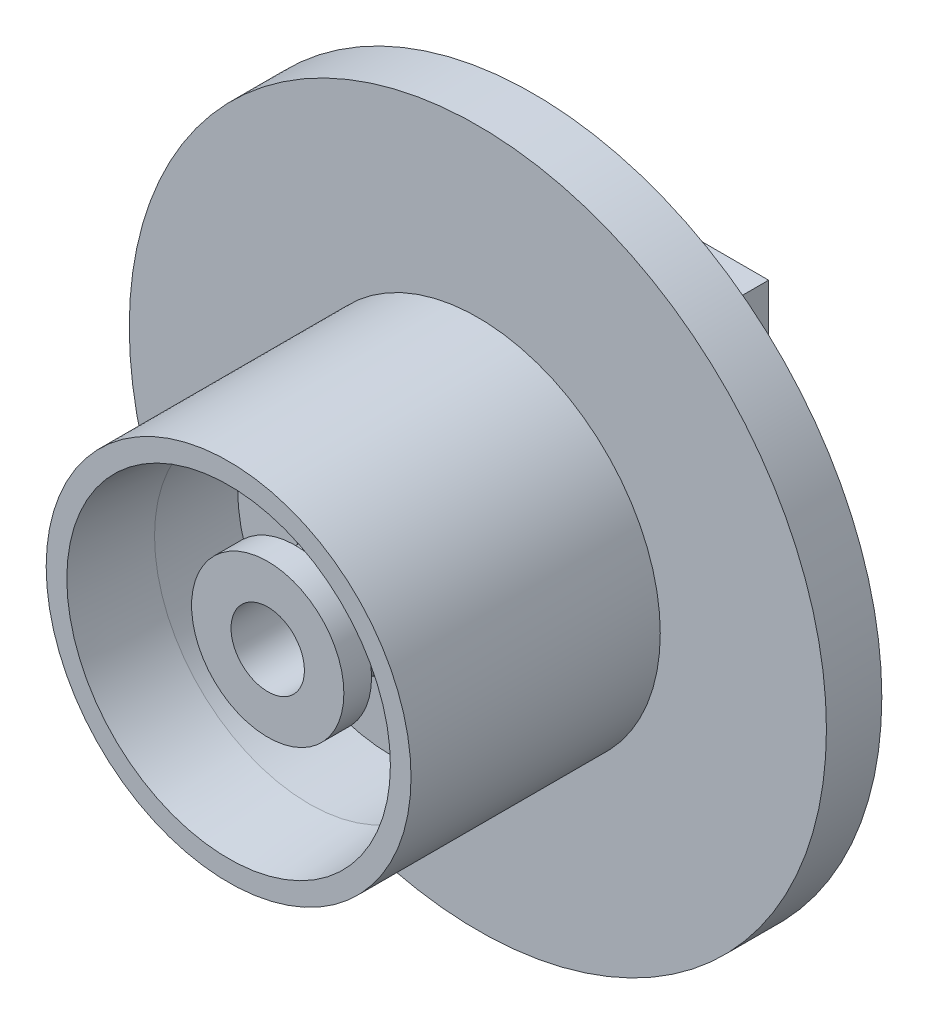
ISO-10303-21;
HEADER;
FILE_DESCRIPTION(('STEP AP214'),'2;1');
FILE_NAME('part.step','',(''),(''),'','','');
FILE_SCHEMA(('AUTOMOTIVE_DESIGN { 1 0 10303 214 1 1 1 1 }'));
ENDSEC;
DATA;
#1=APPLICATION_CONTEXT('core data for automotive mechanical design processes');
#2=APPLICATION_PROTOCOL_DEFINITION('international standard','automotive_design',2000,#1);
#3=PRODUCT_CONTEXT('',#1,'mechanical');
#4=PRODUCT('Part','Part','',(#3));
#5=PRODUCT_RELATED_PRODUCT_CATEGORY('part','',(#4));
#6=PRODUCT_DEFINITION_FORMATION('','',#4);
#7=PRODUCT_DEFINITION_CONTEXT('part definition',#1,'design');
#8=PRODUCT_DEFINITION('design','',#6,#7);
#9=PRODUCT_DEFINITION_SHAPE('','',#8);
#10=(LENGTH_UNIT() NAMED_UNIT(*) SI_UNIT(.MILLI.,.METRE.));
#11=(NAMED_UNIT(*) PLANE_ANGLE_UNIT() SI_UNIT($,.RADIAN.));
#12=(NAMED_UNIT(*) SI_UNIT($,.STERADIAN.) SOLID_ANGLE_UNIT());
#13=UNCERTAINTY_MEASURE_WITH_UNIT(LENGTH_MEASURE(1.E-05),#10,'distance_accuracy_value','');
#14=(GEOMETRIC_REPRESENTATION_CONTEXT(3) GLOBAL_UNCERTAINTY_ASSIGNED_CONTEXT((#13)) GLOBAL_UNIT_ASSIGNED_CONTEXT((#10,
#11,#12)) REPRESENTATION_CONTEXT('',''));
#15=CARTESIAN_POINT('',(0.,0.,0.));
#16=DIRECTION('',(0.,0.,1.));
#17=DIRECTION('',(1.,0.,0.));
#18=AXIS2_PLACEMENT_3D('',#15,#16,#17);
#19=CARTESIAN_POINT('',(0.,0.,-3.96015510839148));
#20=DIRECTION('',(0.,0.,1.));
#21=DIRECTION('',(1.,0.,0.));
#22=AXIS2_PLACEMENT_3D('',#19,#20,#21);
#23=CYLINDRICAL_SURFACE('',#22,2.65);
#24=CARTESIAN_POINT('',(0.,0.,7.4));
#25=DIRECTION('',(0.,0.,1.));
#26=DIRECTION('',(1.,0.,0.));
#27=AXIS2_PLACEMENT_3D('',#24,#25,#26);
#28=CIRCLE('',#27,2.65);
#29=CARTESIAN_POINT('',(2.65,0.,7.4));
#30=VERTEX_POINT('',#29);
#31=EDGE_CURVE('E81',#30,#30,#28,.F.);
#32=ORIENTED_EDGE('',*,*,#31,.T.);
#33=EDGE_LOOP('',(#32));
#34=FACE_BOUND('',#33,.T.);
#35=CARTESIAN_POINT('',(0.,0.,19.175));
#36=DIRECTION('',(0.,0.,1.));
#37=DIRECTION('',(1.,0.,0.));
#38=AXIS2_PLACEMENT_3D('',#35,#36,#37);
#39=CIRCLE('',#38,2.65);
#40=CARTESIAN_POINT('',(2.65,0.,19.175));
#41=VERTEX_POINT('',#40);
#42=EDGE_CURVE('E86',#41,#41,#39,.T.);
#43=ORIENTED_EDGE('',*,*,#42,.T.);
#44=EDGE_LOOP('',(#43));
#45=FACE_BOUND('',#44,.T.);
#46=ADVANCED_FACE('F70',(#34,#45),#23,.F.);
#47=CARTESIAN_POINT('',(0.,0.,-3.96015510839148));
#48=DIRECTION('',(0.,0.,1.));
#49=DIRECTION('',(1.,0.,0.));
#50=AXIS2_PLACEMENT_3D('',#47,#48,#49);
#51=CYLINDRICAL_SURFACE('',#50,3.875);
#52=CARTESIAN_POINT('',(0.,0.,7.4));
#53=DIRECTION('',(0.,0.,1.));
#54=DIRECTION('',(1.,0.,0.));
#55=AXIS2_PLACEMENT_3D('',#52,#53,#54);
#56=CIRCLE('',#55,3.875);
#57=CARTESIAN_POINT('',(3.875,0.,7.4));
#58=VERTEX_POINT('',#57);
#59=EDGE_CURVE('E13',#58,#58,#56,.F.);
#60=ORIENTED_EDGE('',*,*,#59,.F.);
#61=EDGE_LOOP('',(#60));
#62=FACE_BOUND('',#61,.T.);
#63=CARTESIAN_POINT('',(0.,0.,17.175));
#64=DIRECTION('',(0.,0.,1.));
#65=DIRECTION('',(1.,0.,0.));
#66=AXIS2_PLACEMENT_3D('',#63,#64,#65);
#67=CIRCLE('',#66,3.875);
#68=CARTESIAN_POINT('',(3.875,0.,17.175));
#69=VERTEX_POINT('',#68);
#70=EDGE_CURVE('E77',#69,#69,#67,.T.);
#71=ORIENTED_EDGE('',*,*,#70,.F.);
#72=EDGE_LOOP('',(#71));
#73=FACE_BOUND('',#72,.T.);
#74=ADVANCED_FACE('F114',(#62,#73),#51,.T.);
#75=CARTESIAN_POINT('',(0.,0.,7.4));
#76=DIRECTION('',(0.,0.,1.));
#77=DIRECTION('',(1.,0.,0.));
#78=AXIS2_PLACEMENT_3D('',#75,#76,#77);
#79=PLANE('',#78);
#80=ORIENTED_EDGE('',*,*,#59,.T.);
#81=EDGE_LOOP('',(#80));
#82=FACE_BOUND('',#81,.T.);
#83=ORIENTED_EDGE('',*,*,#31,.F.);
#84=EDGE_LOOP('',(#83));
#85=FACE_BOUND('',#84,.T.);
#86=ADVANCED_FACE('F72',(#82,#85),#79,.F.);
#87=CARTESIAN_POINT('',(0.,0.,19.175));
#88=DIRECTION('',(0.,0.,-1.));
#89=DIRECTION('',(-1.,0.,0.));
#90=AXIS2_PLACEMENT_3D('',#87,#88,#89);
#91=CYLINDRICAL_SURFACE('',#90,5.5);
#92=CARTESIAN_POINT('',(0.,0.,19.175));
#93=DIRECTION('',(0.,0.,1.));
#94=DIRECTION('',(1.,0.,0.));
#95=AXIS2_PLACEMENT_3D('',#92,#93,#94);
#96=CIRCLE('',#95,5.5);
#97=CARTESIAN_POINT('',(5.5,0.,19.175));
#98=VERTEX_POINT('',#97);
#99=EDGE_CURVE('E91',#98,#98,#96,.T.);
#100=ORIENTED_EDGE('',*,*,#99,.F.);
#101=EDGE_LOOP('',(#100));
#102=FACE_BOUND('',#101,.T.);
#103=CARTESIAN_POINT('',(0.,0.,17.175));
#104=DIRECTION('',(0.,0.,1.));
#105=DIRECTION('',(1.,0.,0.));
#106=AXIS2_PLACEMENT_3D('',#103,#104,#105);
#107=CIRCLE('',#106,5.5);
#108=CARTESIAN_POINT('',(5.5,0.,17.175));
#109=VERTEX_POINT('',#108);
#110=EDGE_CURVE('E88',#109,#109,#107,.T.);
#111=ORIENTED_EDGE('',*,*,#110,.T.);
#112=EDGE_LOOP('',(#111));
#113=FACE_BOUND('',#112,.T.);
#114=ADVANCED_FACE('F100',(#102,#113),#91,.T.);
#115=CARTESIAN_POINT('',(0.,0.,19.175));
#116=DIRECTION('',(0.,0.,1.));
#117=DIRECTION('',(1.,0.,0.));
#118=AXIS2_PLACEMENT_3D('',#115,#116,#117);
#119=PLANE('',#118);
#120=ORIENTED_EDGE('',*,*,#99,.T.);
#121=EDGE_LOOP('',(#120));
#122=FACE_BOUND('',#121,.T.);
#123=ORIENTED_EDGE('',*,*,#42,.F.);
#124=EDGE_LOOP('',(#123));
#125=FACE_BOUND('',#124,.T.);
#126=ADVANCED_FACE('F97',(#122,#125),#119,.T.);
#127=CARTESIAN_POINT('',(0.,0.,17.175));
#128=DIRECTION('',(0.,0.,1.));
#129=DIRECTION('',(1.,0.,0.));
#130=AXIS2_PLACEMENT_3D('',#127,#128,#129);
#131=PLANE('',#130);
#132=ORIENTED_EDGE('',*,*,#70,.T.);
#133=EDGE_LOOP('',(#132));
#134=FACE_BOUND('',#133,.T.);
#135=ORIENTED_EDGE('',*,*,#110,.F.);
#136=EDGE_LOOP('',(#135));
#137=FACE_BOUND('',#136,.T.);
#138=ADVANCED_FACE('F106',(#134,#137),#131,.F.);
#139=CLOSED_SHELL('',(#46,#74,#86,#114,#126,#138));
#140=MANIFOLD_SOLID_BREP('B2',#139);
#141=CARTESIAN_POINT('',(0.,0.,7.));
#142=DIRECTION('',(0.,0.,-1.));
#143=DIRECTION('',(-1.,0.,0.));
#144=AXIS2_PLACEMENT_3D('',#141,#142,#143);
#145=CYLINDRICAL_SURFACE('',#144,3.875);
#146=CARTESIAN_POINT('',(0.,0.,7.));
#147=DIRECTION('',(0.,0.,1.));
#148=DIRECTION('',(1.,0.,0.));
#149=AXIS2_PLACEMENT_3D('',#146,#147,#148);
#150=CIRCLE('',#149,3.875);
#151=CARTESIAN_POINT('',(3.875,0.,7.));
#152=VERTEX_POINT('',#151);
#153=EDGE_CURVE('E314',#152,#152,#150,.T.);
#154=ORIENTED_EDGE('',*,*,#153,.F.);
#155=EDGE_LOOP('',(#154));
#156=FACE_BOUND('',#155,.T.);
#157=CARTESIAN_POINT('',(0.,0.,-2.));
#158=DIRECTION('',(0.,0.,-1.));
#159=DIRECTION('',(-1.,0.,0.));
#160=AXIS2_PLACEMENT_3D('',#157,#158,#159);
#161=CIRCLE('',#160,3.875);
#162=CARTESIAN_POINT('',(-3.875,0.,-2.));
#163=VERTEX_POINT('',#162);
#164=EDGE_CURVE('E68',#163,#163,#161,.T.);
#165=ORIENTED_EDGE('',*,*,#164,.F.);
#166=EDGE_LOOP('',(#165));
#167=FACE_BOUND('',#166,.T.);
#168=ADVANCED_FACE('F178',(#156,#167),#145,.T.);
#169=CARTESIAN_POINT('',(0.,0.,-3.));
#170=DIRECTION('',(0.,0.,1.));
#171=DIRECTION('',(1.,0.,0.));
#172=AXIS2_PLACEMENT_3D('',#169,#170,#171);
#173=PLANE('',#172);
#174=CARTESIAN_POINT('',(0.,0.,-3.));
#175=DIRECTION('',(0.,0.,1.));
#176=DIRECTION('',(1.,0.,0.));
#177=AXIS2_PLACEMENT_3D('',#174,#175,#176);
#178=CIRCLE('',#177,5.5);
#179=CARTESIAN_POINT('',(5.5,0.,-3.));
#180=VERTEX_POINT('',#179);
#181=EDGE_CURVE('E306',#180,#180,#178,.T.);
#182=ORIENTED_EDGE('',*,*,#181,.F.);
#183=EDGE_LOOP('',(#182));
#184=FACE_BOUND('',#183,.T.);
#185=DIRECTION('',(0.,1.,0.));
#186=VECTOR('',#185,1.);
#187=CARTESIAN_POINT('',(10.,-15.,-3.));
#188=LINE('',#187,#186);
#189=CARTESIAN_POINT('',(10.,-15.,-3.));
#190=VERTEX_POINT('',#189);
#191=CARTESIAN_POINT('',(10.,15.,-3.));
#192=VERTEX_POINT('',#191);
#193=EDGE_CURVE('E248',#190,#192,#188,.T.);
#194=ORIENTED_EDGE('',*,*,#193,.T.);
#195=DIRECTION('',(-1.,0.,0.));
#196=VECTOR('',#195,1.);
#197=CARTESIAN_POINT('',(10.,15.,-3.));
#198=LINE('',#197,#196);
#199=CARTESIAN_POINT('',(-10.,15.,-3.));
#200=VERTEX_POINT('',#199);
#201=EDGE_CURVE('E251',#192,#200,#198,.T.);
#202=ORIENTED_EDGE('',*,*,#201,.T.);
#203=DIRECTION('',(0.,1.,0.));
#204=VECTOR('',#203,1.);
#205=CARTESIAN_POINT('',(-10.,-15.,-3.));
#206=LINE('',#205,#204);
#207=CARTESIAN_POINT('',(-10.,-15.,-3.));
#208=VERTEX_POINT('',#207);
#209=EDGE_CURVE('E237',#208,#200,#206,.T.);
#210=ORIENTED_EDGE('',*,*,#209,.F.);
#211=DIRECTION('',(-1.,0.,0.));
#212=VECTOR('',#211,1.);
#213=CARTESIAN_POINT('',(10.,-15.,-3.));
#214=LINE('',#213,#212);
#215=EDGE_CURVE('E211',#190,#208,#214,.T.);
#216=ORIENTED_EDGE('',*,*,#215,.F.);
#217=EDGE_LOOP('',(#194,#202,#210,#216));
#218=FACE_BOUND('',#217,.T.);
#219=ADVANCED_FACE('F258',(#184,#218),#173,.T.);
#220=CARTESIAN_POINT('',(0.,0.,-7.));
#221=DIRECTION('',(0.,0.,1.));
#222=DIRECTION('',(1.,0.,0.));
#223=AXIS2_PLACEMENT_3D('',#220,#221,#222);
#224=PLANE('',#223);
#225=DIRECTION('',(0.,1.,0.));
#226=VECTOR('',#225,1.);
#227=CARTESIAN_POINT('',(10.,-15.,-7.));
#228=LINE('',#227,#226);
#229=CARTESIAN_POINT('',(10.,-15.,-7.));
#230=VERTEX_POINT('',#229);
#231=CARTESIAN_POINT('',(10.,15.,-7.));
#232=VERTEX_POINT('',#231);
#233=EDGE_CURVE('E242',#230,#232,#228,.T.);
#234=ORIENTED_EDGE('',*,*,#233,.F.);
#235=DIRECTION('',(-1.,0.,0.));
#236=VECTOR('',#235,1.);
#237=CARTESIAN_POINT('',(10.,-15.,-7.));
#238=LINE('',#237,#236);
#239=CARTESIAN_POINT('',(-10.,-15.,-7.));
#240=VERTEX_POINT('',#239);
#241=EDGE_CURVE('E230',#230,#240,#238,.T.);
#242=ORIENTED_EDGE('',*,*,#241,.T.);
#243=DIRECTION('',(0.,1.,0.));
#244=VECTOR('',#243,1.);
#245=CARTESIAN_POINT('',(-10.,-15.,-7.));
#246=LINE('',#245,#244);
#247=CARTESIAN_POINT('',(-10.,15.,-7.));
#248=VERTEX_POINT('',#247);
#249=EDGE_CURVE('E224',#240,#248,#246,.T.);
#250=ORIENTED_EDGE('',*,*,#249,.T.);
#251=DIRECTION('',(-1.,0.,0.));
#252=VECTOR('',#251,1.);
#253=CARTESIAN_POINT('',(10.,15.,-7.));
#254=LINE('',#253,#252);
#255=EDGE_CURVE('E229',#232,#248,#254,.T.);
#256=ORIENTED_EDGE('',*,*,#255,.F.);
#257=EDGE_LOOP('',(#234,#242,#250,#256));
#258=FACE_BOUND('',#257,.T.);
#259=CARTESIAN_POINT('',(0.,0.,-7.));
#260=DIRECTION('',(0.,0.,-1.));
#261=DIRECTION('',(-1.,0.,0.));
#262=AXIS2_PLACEMENT_3D('',#259,#260,#261);
#263=CIRCLE('',#262,2.65);
#264=CARTESIAN_POINT('',(-2.65,0.,-7.));
#265=VERTEX_POINT('',#264);
#266=EDGE_CURVE('E252',#265,#265,#263,.T.);
#267=ORIENTED_EDGE('',*,*,#266,.F.);
#268=EDGE_LOOP('',(#267));
#269=FACE_BOUND('',#268,.T.);
#270=ADVANCED_FACE('F227',(#258,#269),#224,.F.);
#271=CARTESIAN_POINT('',(10.,-15.,-7.));
#272=DIRECTION('',(1.,0.,0.));
#273=DIRECTION('',(0.,0.,-1.));
#274=AXIS2_PLACEMENT_3D('',#271,#272,#273);
#275=PLANE('',#274);
#276=ORIENTED_EDGE('',*,*,#193,.F.);
#277=DIRECTION('',(0.,0.,1.));
#278=VECTOR('',#277,1.);
#279=CARTESIAN_POINT('',(10.,-15.,-7.));
#280=LINE('',#279,#278);
#281=EDGE_CURVE('E187',#230,#190,#280,.T.);
#282=ORIENTED_EDGE('',*,*,#281,.F.);
#283=ORIENTED_EDGE('',*,*,#233,.T.);
#284=DIRECTION('',(0.,0.,1.));
#285=VECTOR('',#284,1.);
#286=CARTESIAN_POINT('',(10.,15.,-7.));
#287=LINE('',#286,#285);
#288=EDGE_CURVE('E219',#232,#192,#287,.T.);
#289=ORIENTED_EDGE('',*,*,#288,.T.);
#290=EDGE_LOOP('',(#276,#282,#283,#289));
#291=FACE_BOUND('',#290,.T.);
#292=ADVANCED_FACE('F180',(#291),#275,.T.);
#293=CARTESIAN_POINT('',(10.,-15.,-7.));
#294=DIRECTION('',(0.,1.,0.));
#295=DIRECTION('',(0.,0.,1.));
#296=AXIS2_PLACEMENT_3D('',#293,#294,#295);
#297=PLANE('',#296);
#298=ORIENTED_EDGE('',*,*,#215,.T.);
#299=DIRECTION('',(0.,0.,1.));
#300=VECTOR('',#299,1.);
#301=CARTESIAN_POINT('',(-10.,-15.,-7.));
#302=LINE('',#301,#300);
#303=EDGE_CURVE('E239',#240,#208,#302,.T.);
#304=ORIENTED_EDGE('',*,*,#303,.F.);
#305=ORIENTED_EDGE('',*,*,#241,.F.);
#306=ORIENTED_EDGE('',*,*,#281,.T.);
#307=EDGE_LOOP('',(#298,#304,#305,#306));
#308=FACE_BOUND('',#307,.T.);
#309=ADVANCED_FACE('F272',(#308),#297,.F.);
#310=CARTESIAN_POINT('',(-10.,-15.,-7.));
#311=DIRECTION('',(1.,0.,0.));
#312=DIRECTION('',(0.,0.,-1.));
#313=AXIS2_PLACEMENT_3D('',#310,#311,#312);
#314=PLANE('',#313);
#315=ORIENTED_EDGE('',*,*,#209,.T.);
#316=DIRECTION('',(0.,0.,1.));
#317=VECTOR('',#316,1.);
#318=CARTESIAN_POINT('',(-10.,15.,-7.));
#319=LINE('',#318,#317);
#320=EDGE_CURVE('E234',#248,#200,#319,.T.);
#321=ORIENTED_EDGE('',*,*,#320,.F.);
#322=ORIENTED_EDGE('',*,*,#249,.F.);
#323=ORIENTED_EDGE('',*,*,#303,.T.);
#324=EDGE_LOOP('',(#315,#321,#322,#323));
#325=FACE_BOUND('',#324,.T.);
#326=ADVANCED_FACE('F235',(#325),#314,.F.);
#327=CARTESIAN_POINT('',(10.,15.,-7.));
#328=DIRECTION('',(0.,1.,0.));
#329=DIRECTION('',(0.,0.,1.));
#330=AXIS2_PLACEMENT_3D('',#327,#328,#329);
#331=PLANE('',#330);
#332=ORIENTED_EDGE('',*,*,#201,.F.);
#333=ORIENTED_EDGE('',*,*,#288,.F.);
#334=ORIENTED_EDGE('',*,*,#255,.T.);
#335=ORIENTED_EDGE('',*,*,#320,.T.);
#336=EDGE_LOOP('',(#332,#333,#334,#335));
#337=FACE_BOUND('',#336,.T.);
#338=ADVANCED_FACE('F241',(#337),#331,.T.);
#339=CARTESIAN_POINT('',(0.,0.,-7.));
#340=DIRECTION('',(0.,0.,1.));
#341=DIRECTION('',(1.,0.,0.));
#342=AXIS2_PLACEMENT_3D('',#339,#340,#341);
#343=CYLINDRICAL_SURFACE('',#342,2.65);
#344=ORIENTED_EDGE('',*,*,#266,.T.);
#345=EDGE_LOOP('',(#344));
#346=FACE_BOUND('',#345,.T.);
#347=CARTESIAN_POINT('',(0.,0.,7.));
#348=DIRECTION('',(0.,0.,1.));
#349=DIRECTION('',(1.,0.,0.));
#350=AXIS2_PLACEMENT_3D('',#347,#348,#349);
#351=CIRCLE('',#350,2.65);
#352=CARTESIAN_POINT('',(2.65,0.,7.));
#353=VERTEX_POINT('',#352);
#354=EDGE_CURVE('E309',#353,#353,#351,.T.);
#355=ORIENTED_EDGE('',*,*,#354,.T.);
#356=EDGE_LOOP('',(#355));
#357=FACE_BOUND('',#356,.T.);
#358=ADVANCED_FACE('F277',(#346,#357),#343,.F.);
#359=CARTESIAN_POINT('',(0.,0.,7.));
#360=DIRECTION('',(0.,0.,1.));
#361=DIRECTION('',(1.,0.,0.));
#362=AXIS2_PLACEMENT_3D('',#359,#360,#361);
#363=PLANE('',#362);
#364=ORIENTED_EDGE('',*,*,#153,.T.);
#365=EDGE_LOOP('',(#364));
#366=FACE_BOUND('',#365,.T.);
#367=ORIENTED_EDGE('',*,*,#354,.F.);
#368=EDGE_LOOP('',(#367));
#369=FACE_BOUND('',#368,.T.);
#370=ADVANCED_FACE('F281',(#366,#369),#363,.T.);
#371=CARTESIAN_POINT('',(0.,0.,-2.));
#372=DIRECTION('',(0.,0.,-1.));
#373=DIRECTION('',(-1.,0.,0.));
#374=AXIS2_PLACEMENT_3D('',#371,#372,#373);
#375=PLANE('',#374);
#376=ORIENTED_EDGE('',*,*,#164,.T.);
#377=EDGE_LOOP('',(#376));
#378=FACE_BOUND('',#377,.T.);
#379=CARTESIAN_POINT('',(0.,0.,-2.));
#380=DIRECTION('',(0.,0.,-1.));
#381=DIRECTION('',(-1.,0.,0.));
#382=AXIS2_PLACEMENT_3D('',#379,#380,#381);
#383=CIRCLE('',#382,5.5);
#384=CARTESIAN_POINT('',(-5.5,0.,-2.));
#385=VERTEX_POINT('',#384);
#386=EDGE_CURVE('E304',#385,#385,#383,.T.);
#387=ORIENTED_EDGE('',*,*,#386,.F.);
#388=EDGE_LOOP('',(#387));
#389=FACE_BOUND('',#388,.T.);
#390=ADVANCED_FACE('F286',(#378,#389),#375,.F.);
#391=CARTESIAN_POINT('',(0.,0.,-18.556349186104));
#392=DIRECTION('',(0.,0.,1.));
#393=DIRECTION('',(1.,0.,0.));
#394=AXIS2_PLACEMENT_3D('',#391,#392,#393);
#395=CYLINDRICAL_SURFACE('',#394,5.5);
#396=ORIENTED_EDGE('',*,*,#181,.T.);
#397=EDGE_LOOP('',(#396));
#398=FACE_BOUND('',#397,.T.);
#399=ORIENTED_EDGE('',*,*,#386,.T.);
#400=EDGE_LOOP('',(#399));
#401=FACE_BOUND('',#400,.T.);
#402=ADVANCED_FACE('F292',(#398,#401),#395,.T.);
#403=CLOSED_SHELL('',(#168,#219,#270,#292,#309,#326,#338,#358,#370,#390,#402));
#404=MANIFOLD_SOLID_BREP('B8',#403);
#405=CARTESIAN_POINT('',(25.175,0.,0.));
#406=DIRECTION('',(0.,0.,1.));
#407=DIRECTION('',(1.,0.,0.));
#408=AXIS2_PLACEMENT_3D('',#405,#406,#407);
#409=PLANE('',#408);
#410=CARTESIAN_POINT('',(0.,0.,0.));
#411=DIRECTION('',(0.,0.,-1.));
#412=DIRECTION('',(-1.,0.,0.));
#413=AXIS2_PLACEMENT_3D('',#410,#411,#412);
#414=CIRCLE('',#413,11.175);
#415=CARTESIAN_POINT('',(-11.175,0.,0.));
#416=VERTEX_POINT('',#415);
#417=EDGE_CURVE('E177',#416,#416,#414,.T.);
#418=ORIENTED_EDGE('',*,*,#417,.F.);
#419=EDGE_LOOP('',(#418));
#420=FACE_BOUND('',#419,.T.);
#421=CARTESIAN_POINT('',(0.,0.,0.));
#422=DIRECTION('',(0.,0.,-1.));
#423=DIRECTION('',(-1.,0.,0.));
#424=AXIS2_PLACEMENT_3D('',#421,#422,#423);
#425=CIRCLE('',#424,25.175);
#426=CARTESIAN_POINT('',(-25.175,0.,0.));
#427=VERTEX_POINT('',#426);
#428=EDGE_CURVE('E422',#427,#427,#425,.T.);
#429=ORIENTED_EDGE('',*,*,#428,.T.);
#430=EDGE_LOOP('',(#429));
#431=FACE_BOUND('',#430,.T.);
#432=ADVANCED_FACE('F385',(#420,#431),#409,.F.);
#433=CARTESIAN_POINT('',(0.,0.,0.));
#434=DIRECTION('',(0.,0.,-1.));
#435=DIRECTION('',(-1.,0.,0.));
#436=AXIS2_PLACEMENT_3D('',#433,#434,#435);
#437=CYLINDRICAL_SURFACE('',#436,11.175);
#438=CARTESIAN_POINT('',(0.,0.,5.));
#439=DIRECTION('',(0.,0.,-1.));
#440=DIRECTION('',(-1.,0.,0.));
#441=AXIS2_PLACEMENT_3D('',#438,#439,#440);
#442=CIRCLE('',#441,11.175);
#443=CARTESIAN_POINT('',(-11.175,0.,5.00000000000001));
#444=VERTEX_POINT('',#443);
#445=EDGE_CURVE('E391',#444,#444,#442,.T.);
#446=ORIENTED_EDGE('',*,*,#445,.F.);
#447=EDGE_LOOP('',(#446));
#448=FACE_BOUND('',#447,.T.);
#449=ORIENTED_EDGE('',*,*,#417,.T.);
#450=EDGE_LOOP('',(#449));
#451=FACE_BOUND('',#450,.T.);
#452=ADVANCED_FACE('F477',(#448,#451),#437,.F.);
#453=CARTESIAN_POINT('',(0.,0.,5.));
#454=DIRECTION('',(0.,0.,-1.));
#455=DIRECTION('',(-1.,0.,0.));
#456=AXIS2_PLACEMENT_3D('',#453,#454,#455);
#457=CONICAL_SURFACE('',#456,11.175,0.785398163397451);
#458=CARTESIAN_POINT('',(0.,0.,9.17499999999998));
#459=DIRECTION('',(0.,0.,-1.));
#460=DIRECTION('',(-1.,0.,0.));
#461=AXIS2_PLACEMENT_3D('',#458,#459,#460);
#462=CIRCLE('',#461,7.);
#463=CARTESIAN_POINT('',(-7.,0.,9.17499999999998));
#464=VERTEX_POINT('',#463);
#465=EDGE_CURVE('E395',#464,#464,#462,.T.);
#466=ORIENTED_EDGE('',*,*,#465,.F.);
#467=EDGE_LOOP('',(#466));
#468=FACE_BOUND('',#467,.T.);
#469=ORIENTED_EDGE('',*,*,#445,.T.);
#470=EDGE_LOOP('',(#469));
#471=FACE_BOUND('',#470,.T.);
#472=ADVANCED_FACE('F472',(#468,#471),#457,.F.);
#473=CARTESIAN_POINT('',(0.,0.,0.));
#474=DIRECTION('',(0.,0.,-1.));
#475=DIRECTION('',(-1.,0.,0.));
#476=AXIS2_PLACEMENT_3D('',#473,#474,#475);
#477=CYLINDRICAL_SURFACE('',#476,7.);
#478=CARTESIAN_POINT('',(0.,0.,10.175));
#479=DIRECTION('',(0.,0.,-1.));
#480=DIRECTION('',(-1.,0.,0.));
#481=AXIS2_PLACEMENT_3D('',#478,#479,#480);
#482=CIRCLE('',#481,7.);
#483=CARTESIAN_POINT('',(-7.,0.,10.175));
#484=VERTEX_POINT('',#483);
#485=EDGE_CURVE('E399',#484,#484,#482,.T.);
#486=ORIENTED_EDGE('',*,*,#485,.F.);
#487=EDGE_LOOP('',(#486));
#488=FACE_BOUND('',#487,.T.);
#489=ORIENTED_EDGE('',*,*,#465,.T.);
#490=EDGE_LOOP('',(#489));
#491=FACE_BOUND('',#490,.T.);
#492=ADVANCED_FACE('F466',(#488,#491),#477,.F.);
#493=CARTESIAN_POINT('',(7.,0.,10.175));
#494=DIRECTION('',(0.,0.,-1.));
#495=DIRECTION('',(-1.,0.,0.));
#496=AXIS2_PLACEMENT_3D('',#493,#494,#495);
#497=PLANE('',#496);
#498=CARTESIAN_POINT('',(0.,0.,10.175));
#499=DIRECTION('',(0.,0.,-1.));
#500=DIRECTION('',(-1.,0.,0.));
#501=AXIS2_PLACEMENT_3D('',#498,#499,#500);
#502=CIRCLE('',#501,11.175);
#503=CARTESIAN_POINT('',(-11.175,0.,10.175));
#504=VERTEX_POINT('',#503);
#505=EDGE_CURVE('E404',#504,#504,#502,.T.);
#506=ORIENTED_EDGE('',*,*,#505,.F.);
#507=EDGE_LOOP('',(#506));
#508=FACE_BOUND('',#507,.T.);
#509=ORIENTED_EDGE('',*,*,#485,.T.);
#510=EDGE_LOOP('',(#509));
#511=FACE_BOUND('',#510,.T.);
#512=ADVANCED_FACE('F460',(#508,#511),#497,.F.);
#513=CARTESIAN_POINT('',(0.,0.,0.));
#514=DIRECTION('',(0.,0.,-1.));
#515=DIRECTION('',(-1.,0.,0.));
#516=AXIS2_PLACEMENT_3D('',#513,#514,#515);
#517=CYLINDRICAL_SURFACE('',#516,11.175);
#518=CARTESIAN_POINT('',(0.,0.,16.175));
#519=DIRECTION('',(0.,0.,-1.));
#520=DIRECTION('',(-1.,0.,0.));
#521=AXIS2_PLACEMENT_3D('',#518,#519,#520);
#522=CIRCLE('',#521,11.175);
#523=CARTESIAN_POINT('',(-11.175,0.,16.175));
#524=VERTEX_POINT('',#523);
#525=EDGE_CURVE('E407',#524,#524,#522,.T.);
#526=ORIENTED_EDGE('',*,*,#525,.F.);
#527=EDGE_LOOP('',(#526));
#528=FACE_BOUND('',#527,.T.);
#529=ORIENTED_EDGE('',*,*,#505,.T.);
#530=EDGE_LOOP('',(#529));
#531=FACE_BOUND('',#530,.T.);
#532=ADVANCED_FACE('F454',(#528,#531),#517,.F.);
#533=CARTESIAN_POINT('',(0.,0.,16.175));
#534=DIRECTION('',(0.,0.,1.));
#535=DIRECTION('',(1.,0.,0.));
#536=AXIS2_PLACEMENT_3D('',#533,#534,#535);
#537=CONICAL_SURFACE('',#536,11.175,0.0872664625997167);
#538=CARTESIAN_POINT('',(0.,0.,22.));
#539=DIRECTION('',(0.,0.,-1.));
#540=DIRECTION('',(-1.,0.,0.));
#541=AXIS2_PLACEMENT_3D('',#538,#539,#540);
#542=CIRCLE('',#541,11.6846214650385);
#543=CARTESIAN_POINT('',(-11.6846214650385,0.,22.));
#544=VERTEX_POINT('',#543);
#545=EDGE_CURVE('E410',#544,#544,#542,.T.);
#546=ORIENTED_EDGE('',*,*,#545,.F.);
#547=EDGE_LOOP('',(#546));
#548=FACE_BOUND('',#547,.T.);
#549=ORIENTED_EDGE('',*,*,#525,.T.);
#550=EDGE_LOOP('',(#549));
#551=FACE_BOUND('',#550,.T.);
#552=ADVANCED_FACE('F448',(#548,#551),#537,.F.);
#553=CARTESIAN_POINT('',(11.6846214650385,0.,22.));
#554=DIRECTION('',(0.,0.,-1.));
#555=DIRECTION('',(-1.,0.,0.));
#556=AXIS2_PLACEMENT_3D('',#553,#554,#555);
#557=PLANE('',#556);
#558=CARTESIAN_POINT('',(0.,0.,22.));
#559=DIRECTION('',(0.,0.,-1.));
#560=DIRECTION('',(-1.,0.,0.));
#561=AXIS2_PLACEMENT_3D('',#558,#559,#560);
#562=CIRCLE('',#561,13.175);
#563=CARTESIAN_POINT('',(-13.175,0.,22.));
#564=VERTEX_POINT('',#563);
#565=EDGE_CURVE('E413',#564,#564,#562,.T.);
#566=ORIENTED_EDGE('',*,*,#565,.F.);
#567=EDGE_LOOP('',(#566));
#568=FACE_BOUND('',#567,.T.);
#569=ORIENTED_EDGE('',*,*,#545,.T.);
#570=EDGE_LOOP('',(#569));
#571=FACE_BOUND('',#570,.T.);
#572=ADVANCED_FACE('F442',(#568,#571),#557,.F.);
#573=CARTESIAN_POINT('',(0.,0.,0.));
#574=DIRECTION('',(0.,0.,-1.));
#575=DIRECTION('',(-1.,0.,0.));
#576=AXIS2_PLACEMENT_3D('',#573,#574,#575);
#577=CYLINDRICAL_SURFACE('',#576,13.175);
#578=CARTESIAN_POINT('',(0.,0.,4.));
#579=DIRECTION('',(0.,0.,-1.));
#580=DIRECTION('',(-1.,0.,0.));
#581=AXIS2_PLACEMENT_3D('',#578,#579,#580);
#582=CIRCLE('',#581,13.175);
#583=CARTESIAN_POINT('',(-13.175,0.,4.));
#584=VERTEX_POINT('',#583);
#585=EDGE_CURVE('E416',#584,#584,#582,.T.);
#586=ORIENTED_EDGE('',*,*,#585,.F.);
#587=EDGE_LOOP('',(#586));
#588=FACE_BOUND('',#587,.T.);
#589=ORIENTED_EDGE('',*,*,#565,.T.);
#590=EDGE_LOOP('',(#589));
#591=FACE_BOUND('',#590,.T.);
#592=ADVANCED_FACE('F436',(#588,#591),#577,.T.);
#593=CARTESIAN_POINT('',(13.175,0.,4.));
#594=DIRECTION('',(0.,0.,-1.));
#595=DIRECTION('',(-1.,0.,0.));
#596=AXIS2_PLACEMENT_3D('',#593,#594,#595);
#597=PLANE('',#596);
#598=CARTESIAN_POINT('',(0.,0.,4.));
#599=DIRECTION('',(0.,0.,-1.));
#600=DIRECTION('',(-1.,0.,0.));
#601=AXIS2_PLACEMENT_3D('',#598,#599,#600);
#602=CIRCLE('',#601,25.175);
#603=CARTESIAN_POINT('',(-25.175,0.,4.00000000000001));
#604=VERTEX_POINT('',#603);
#605=EDGE_CURVE('E419',#604,#604,#602,.T.);
#606=ORIENTED_EDGE('',*,*,#605,.F.);
#607=EDGE_LOOP('',(#606));
#608=FACE_BOUND('',#607,.T.);
#609=ORIENTED_EDGE('',*,*,#585,.T.);
#610=EDGE_LOOP('',(#609));
#611=FACE_BOUND('',#610,.T.);
#612=ADVANCED_FACE('F430',(#608,#611),#597,.F.);
#613=CARTESIAN_POINT('',(0.,0.,0.));
#614=DIRECTION('',(0.,0.,-1.));
#615=DIRECTION('',(-1.,0.,0.));
#616=AXIS2_PLACEMENT_3D('',#613,#614,#615);
#617=CYLINDRICAL_SURFACE('',#616,25.175);
#618=ORIENTED_EDGE('',*,*,#428,.F.);
#619=EDGE_LOOP('',(#618));
#620=FACE_BOUND('',#619,.T.);
#621=ORIENTED_EDGE('',*,*,#605,.T.);
#622=EDGE_LOOP('',(#621));
#623=FACE_BOUND('',#622,.T.);
#624=ADVANCED_FACE('F427',(#620,#623),#617,.T.);
#625=CLOSED_SHELL('',(#432,#452,#472,#492,#512,#532,#552,#572,#592,#612,#624));
#626=MANIFOLD_SOLID_BREP('B62',#625);
#627=ADVANCED_BREP_SHAPE_REPRESENTATION('',(#18,#140,#404,#626),#14);
#628=SHAPE_DEFINITION_REPRESENTATION(#9,#627);
ENDSEC;
END-ISO-10303-21;
